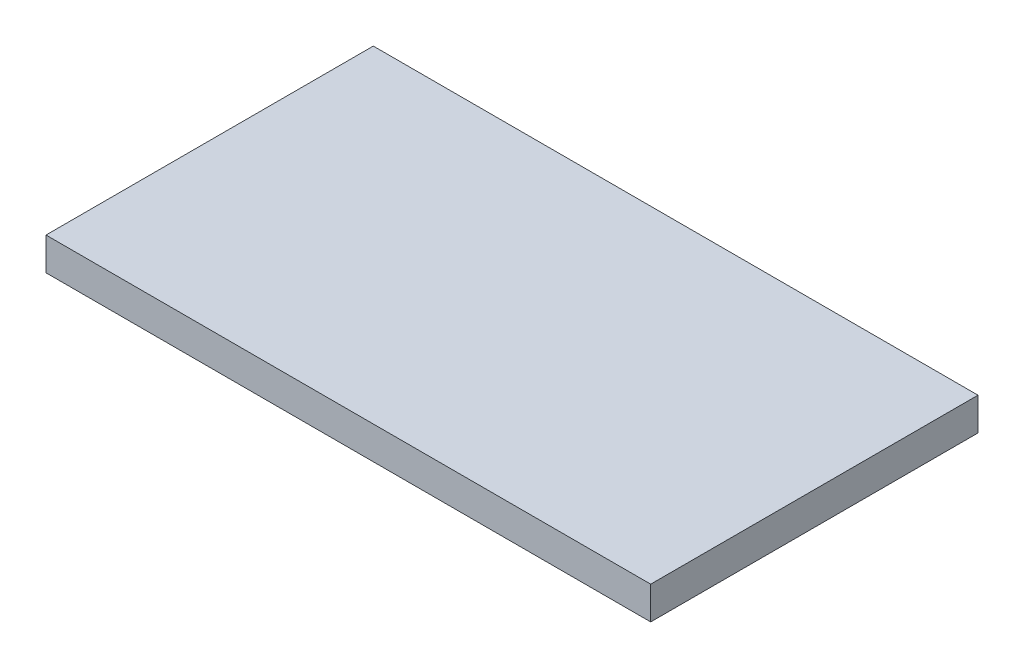
ISO-10303-21;
HEADER;
FILE_DESCRIPTION(('STEP AP214'),'2;1');
FILE_NAME('part.step','',(''),(''),'','','');
FILE_SCHEMA(('AUTOMOTIVE_DESIGN { 1 0 10303 214 1 1 1 1 }'));
ENDSEC;
DATA;
#1=APPLICATION_CONTEXT('core data for automotive mechanical design processes');
#2=APPLICATION_PROTOCOL_DEFINITION('international standard','automotive_design',2000,#1);
#3=PRODUCT_CONTEXT('',#1,'mechanical');
#4=PRODUCT('Part','Part','',(#3));
#5=PRODUCT_RELATED_PRODUCT_CATEGORY('part','',(#4));
#6=PRODUCT_DEFINITION_FORMATION('','',#4);
#7=PRODUCT_DEFINITION_CONTEXT('part definition',#1,'design');
#8=PRODUCT_DEFINITION('design','',#6,#7);
#9=PRODUCT_DEFINITION_SHAPE('','',#8);
#10=(LENGTH_UNIT() NAMED_UNIT(*) SI_UNIT(.MILLI.,.METRE.));
#11=(NAMED_UNIT(*) PLANE_ANGLE_UNIT() SI_UNIT($,.RADIAN.));
#12=(NAMED_UNIT(*) SI_UNIT($,.STERADIAN.) SOLID_ANGLE_UNIT());
#13=UNCERTAINTY_MEASURE_WITH_UNIT(LENGTH_MEASURE(1.E-05),#10,'distance_accuracy_value','');
#14=(GEOMETRIC_REPRESENTATION_CONTEXT(3) GLOBAL_UNCERTAINTY_ASSIGNED_CONTEXT((#13)) GLOBAL_UNIT_ASSIGNED_CONTEXT((#10,
#11,#12)) REPRESENTATION_CONTEXT('',''));
#15=CARTESIAN_POINT('',(0.,0.,0.));
#16=DIRECTION('',(0.,0.,1.));
#17=DIRECTION('',(1.,0.,0.));
#18=AXIS2_PLACEMENT_3D('',#15,#16,#17);
#19=CARTESIAN_POINT('',(92.375,10.,50.));
#20=DIRECTION('',(-1.,0.,0.));
#21=DIRECTION('',(0.,0.,1.));
#22=AXIS2_PLACEMENT_3D('',#19,#20,#21);
#23=PLANE('',#22);
#24=DIRECTION('',(0.,0.,-1.));
#25=VECTOR('',#24,1.);
#26=CARTESIAN_POINT('',(92.375,0.,50.));
#27=LINE('',#26,#25);
#28=CARTESIAN_POINT('',(92.375,0.,50.));
#29=VERTEX_POINT('',#28);
#30=CARTESIAN_POINT('',(92.375,0.,-50.));
#31=VERTEX_POINT('',#30);
#32=EDGE_CURVE('E96',#29,#31,#27,.T.);
#33=ORIENTED_EDGE('',*,*,#32,.T.);
#34=DIRECTION('',(0.,-1.,0.));
#35=VECTOR('',#34,1.);
#36=CARTESIAN_POINT('',(92.375,10.,-50.));
#37=LINE('',#36,#35);
#38=CARTESIAN_POINT('',(92.375,10.,-50.));
#39=VERTEX_POINT('',#38);
#40=EDGE_CURVE('E11',#39,#31,#37,.T.);
#41=ORIENTED_EDGE('',*,*,#40,.F.);
#42=DIRECTION('',(0.,0.,-1.));
#43=VECTOR('',#42,1.);
#44=CARTESIAN_POINT('',(92.375,10.,50.));
#45=LINE('',#44,#43);
#46=CARTESIAN_POINT('',(92.375,10.,50.));
#47=VERTEX_POINT('',#46);
#48=EDGE_CURVE('E84',#47,#39,#45,.T.);
#49=ORIENTED_EDGE('',*,*,#48,.F.);
#50=DIRECTION('',(0.,-1.,0.));
#51=VECTOR('',#50,1.);
#52=CARTESIAN_POINT('',(92.375,10.,50.));
#53=LINE('',#52,#51);
#54=EDGE_CURVE('E92',#47,#29,#53,.T.);
#55=ORIENTED_EDGE('',*,*,#54,.T.);
#56=EDGE_LOOP('',(#33,#41,#49,#55));
#57=FACE_BOUND('',#56,.T.);
#58=ADVANCED_FACE('F33',(#57),#23,.F.);
#59=CARTESIAN_POINT('',(-92.375,10.,-50.));
#60=DIRECTION('',(0.,0.,1.));
#61=DIRECTION('',(1.,0.,0.));
#62=AXIS2_PLACEMENT_3D('',#59,#60,#61);
#63=PLANE('',#62);
#64=DIRECTION('',(-1.,0.,0.));
#65=VECTOR('',#64,1.);
#66=CARTESIAN_POINT('',(-92.375,0.,-50.));
#67=LINE('',#66,#65);
#68=CARTESIAN_POINT('',(-92.375,0.,-50.));
#69=VERTEX_POINT('',#68);
#70=EDGE_CURVE('E88',#31,#69,#67,.T.);
#71=ORIENTED_EDGE('',*,*,#70,.T.);
#72=DIRECTION('',(0.,-1.,0.));
#73=VECTOR('',#72,1.);
#74=CARTESIAN_POINT('',(-92.375,10.,-50.));
#75=LINE('',#74,#73);
#76=CARTESIAN_POINT('',(-92.375,10.,-50.));
#77=VERTEX_POINT('',#76);
#78=EDGE_CURVE('E41',#77,#69,#75,.T.);
#79=ORIENTED_EDGE('',*,*,#78,.F.);
#80=DIRECTION('',(-1.,0.,0.));
#81=VECTOR('',#80,1.);
#82=CARTESIAN_POINT('',(-92.375,10.,-50.));
#83=LINE('',#82,#81);
#84=EDGE_CURVE('E79',#39,#77,#83,.T.);
#85=ORIENTED_EDGE('',*,*,#84,.F.);
#86=ORIENTED_EDGE('',*,*,#40,.T.);
#87=EDGE_LOOP('',(#71,#79,#85,#86));
#88=FACE_BOUND('',#87,.T.);
#89=ADVANCED_FACE('F87',(#88),#63,.F.);
#90=CARTESIAN_POINT('',(-92.375,10.,50.));
#91=DIRECTION('',(1.,0.,0.));
#92=DIRECTION('',(0.,0.,-1.));
#93=AXIS2_PLACEMENT_3D('',#90,#91,#92);
#94=PLANE('',#93);
#95=DIRECTION('',(0.,0.,1.));
#96=VECTOR('',#95,1.);
#97=CARTESIAN_POINT('',(-92.375,0.,50.));
#98=LINE('',#97,#96);
#99=CARTESIAN_POINT('',(-92.375,0.,50.));
#100=VERTEX_POINT('',#99);
#101=EDGE_CURVE('E66',#69,#100,#98,.T.);
#102=ORIENTED_EDGE('',*,*,#101,.T.);
#103=DIRECTION('',(0.,-1.,0.));
#104=VECTOR('',#103,1.);
#105=CARTESIAN_POINT('',(-92.375,10.,50.));
#106=LINE('',#105,#104);
#107=CARTESIAN_POINT('',(-92.375,10.,50.));
#108=VERTEX_POINT('',#107);
#109=EDGE_CURVE('E89',#108,#100,#106,.T.);
#110=ORIENTED_EDGE('',*,*,#109,.F.);
#111=DIRECTION('',(0.,0.,1.));
#112=VECTOR('',#111,1.);
#113=CARTESIAN_POINT('',(-92.375,10.,50.));
#114=LINE('',#113,#112);
#115=EDGE_CURVE('E82',#77,#108,#114,.T.);
#116=ORIENTED_EDGE('',*,*,#115,.F.);
#117=ORIENTED_EDGE('',*,*,#78,.T.);
#118=EDGE_LOOP('',(#102,#110,#116,#117));
#119=FACE_BOUND('',#118,.T.);
#120=ADVANCED_FACE('F90',(#119),#94,.F.);
#121=CARTESIAN_POINT('',(-92.375,10.,50.));
#122=DIRECTION('',(0.,0.,-1.));
#123=DIRECTION('',(-1.,0.,0.));
#124=AXIS2_PLACEMENT_3D('',#121,#122,#123);
#125=PLANE('',#124);
#126=DIRECTION('',(1.,0.,0.));
#127=VECTOR('',#126,1.);
#128=CARTESIAN_POINT('',(-92.375,0.,50.));
#129=LINE('',#128,#127);
#130=EDGE_CURVE('E72',#100,#29,#129,.T.);
#131=ORIENTED_EDGE('',*,*,#130,.T.);
#132=ORIENTED_EDGE('',*,*,#54,.F.);
#133=DIRECTION('',(1.,0.,0.));
#134=VECTOR('',#133,1.);
#135=CARTESIAN_POINT('',(-92.375,10.,50.));
#136=LINE('',#135,#134);
#137=EDGE_CURVE('E49',#108,#47,#136,.T.);
#138=ORIENTED_EDGE('',*,*,#137,.F.);
#139=ORIENTED_EDGE('',*,*,#109,.T.);
#140=EDGE_LOOP('',(#131,#132,#138,#139));
#141=FACE_BOUND('',#140,.T.);
#142=ADVANCED_FACE('F103',(#141),#125,.F.);
#143=CARTESIAN_POINT('',(0.,10.,0.));
#144=DIRECTION('',(0.,-1.,0.));
#145=DIRECTION('',(0.,0.,-1.));
#146=AXIS2_PLACEMENT_3D('',#143,#144,#145);
#147=PLANE('',#146);
#148=ORIENTED_EDGE('',*,*,#48,.T.);
#149=ORIENTED_EDGE('',*,*,#84,.T.);
#150=ORIENTED_EDGE('',*,*,#115,.T.);
#151=ORIENTED_EDGE('',*,*,#137,.T.);
#152=EDGE_LOOP('',(#148,#149,#150,#151));
#153=FACE_BOUND('',#152,.T.);
#154=ADVANCED_FACE('F80',(#153),#147,.F.);
#155=CARTESIAN_POINT('',(0.,0.,0.));
#156=DIRECTION('',(0.,-1.,0.));
#157=DIRECTION('',(0.,0.,-1.));
#158=AXIS2_PLACEMENT_3D('',#155,#156,#157);
#159=PLANE('',#158);
#160=ORIENTED_EDGE('',*,*,#32,.F.);
#161=ORIENTED_EDGE('',*,*,#130,.F.);
#162=ORIENTED_EDGE('',*,*,#101,.F.);
#163=ORIENTED_EDGE('',*,*,#70,.F.);
#164=EDGE_LOOP('',(#160,#161,#162,#163));
#165=FACE_BOUND('',#164,.T.);
#166=ADVANCED_FACE('F106',(#165),#159,.T.);
#167=CLOSED_SHELL('',(#58,#89,#120,#142,#154,#166));
#168=MANIFOLD_SOLID_BREP('B2',#167);
#169=ADVANCED_BREP_SHAPE_REPRESENTATION('',(#18,#168),#14);
#170=SHAPE_DEFINITION_REPRESENTATION(#9,#169);
ENDSEC;
END-ISO-10303-21;
